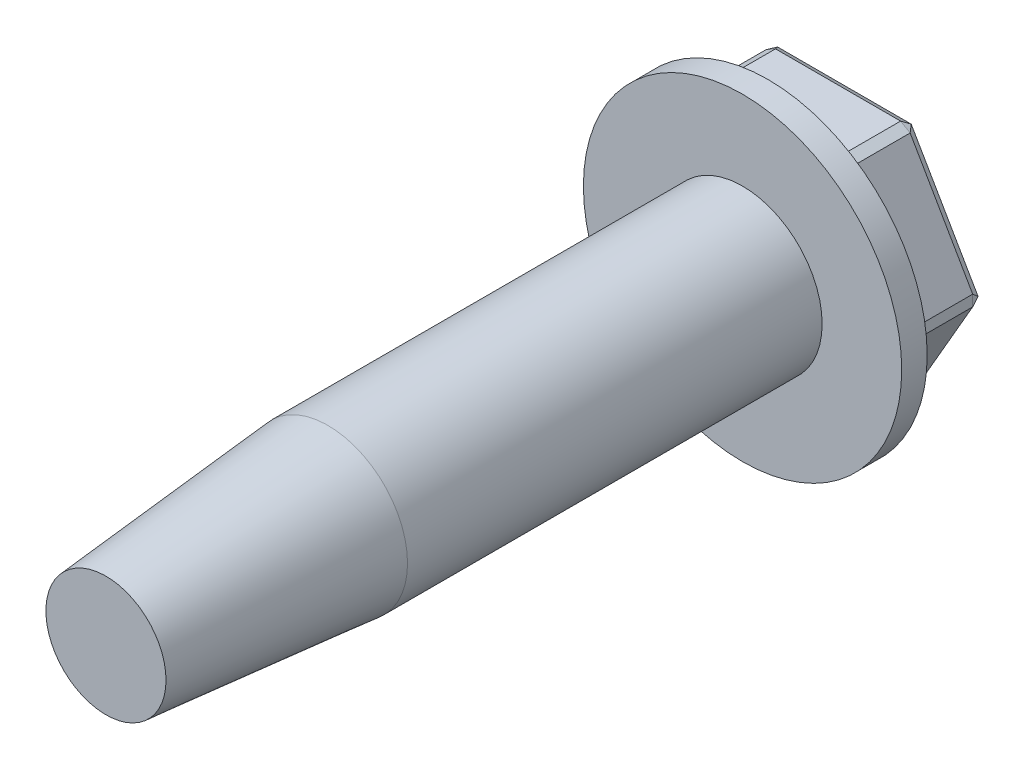
ISO-10303-21;
HEADER;
FILE_DESCRIPTION(('STEP AP214'),'2;1');
FILE_NAME('part.step','',(''),(''),'','','');
FILE_SCHEMA(('AUTOMOTIVE_DESIGN { 1 0 10303 214 1 1 1 1 }'));
ENDSEC;
DATA;
#1=APPLICATION_CONTEXT('core data for automotive mechanical design processes');
#2=APPLICATION_PROTOCOL_DEFINITION('international standard','automotive_design',2000,#1);
#3=PRODUCT_CONTEXT('',#1,'mechanical');
#4=PRODUCT('Part','Part','',(#3));
#5=PRODUCT_RELATED_PRODUCT_CATEGORY('part','',(#4));
#6=PRODUCT_DEFINITION_FORMATION('','',#4);
#7=PRODUCT_DEFINITION_CONTEXT('part definition',#1,'design');
#8=PRODUCT_DEFINITION('design','',#6,#7);
#9=PRODUCT_DEFINITION_SHAPE('','',#8);
#10=(LENGTH_UNIT() NAMED_UNIT(*) SI_UNIT(.MILLI.,.METRE.));
#11=(NAMED_UNIT(*) PLANE_ANGLE_UNIT() SI_UNIT($,.RADIAN.));
#12=(NAMED_UNIT(*) SI_UNIT($,.STERADIAN.) SOLID_ANGLE_UNIT());
#13=UNCERTAINTY_MEASURE_WITH_UNIT(LENGTH_MEASURE(1.E-05),#10,'distance_accuracy_value','');
#14=(GEOMETRIC_REPRESENTATION_CONTEXT(3) GLOBAL_UNCERTAINTY_ASSIGNED_CONTEXT((#13)) GLOBAL_UNIT_ASSIGNED_CONTEXT((#10,
#11,#12)) REPRESENTATION_CONTEXT('',''));
#15=CARTESIAN_POINT('',(0.,0.,0.));
#16=DIRECTION('',(0.,0.,1.));
#17=DIRECTION('',(1.,0.,0.));
#18=AXIS2_PLACEMENT_3D('',#15,#16,#17);
#19=CARTESIAN_POINT('',(6.35,0.,4.064));
#20=DIRECTION('',(0.,0.,1.));
#21=DIRECTION('',(1.,0.,0.));
#22=AXIS2_PLACEMENT_3D('',#19,#20,#21);
#23=PLANE('',#22);
#24=CARTESIAN_POINT('',(0.,0.,4.06399999999999));
#25=DIRECTION('',(0.,0.,-1.));
#26=DIRECTION('',(-1.,0.,0.));
#27=AXIS2_PLACEMENT_3D('',#24,#25,#26);
#28=CIRCLE('',#27,6.35);
#29=CARTESIAN_POINT('',(-6.35,0.,4.06399999999999));
#30=VERTEX_POINT('',#29);
#31=EDGE_CURVE('E188',#30,#30,#28,.T.);
#32=ORIENTED_EDGE('',*,*,#31,.F.);
#33=EDGE_LOOP('',(#32));
#34=FACE_BOUND('',#33,.T.);
#35=CARTESIAN_POINT('',(0.,0.,4.064));
#36=DIRECTION('',(0.,0.,1.));
#37=DIRECTION('',(1.,0.,0.));
#38=AXIS2_PLACEMENT_3D('',#35,#36,#37);
#39=CIRCLE('',#38,3.175);
#40=CARTESIAN_POINT('',(3.175,0.,4.064));
#41=VERTEX_POINT('',#40);
#42=EDGE_CURVE('E291',#41,#41,#39,.T.);
#43=ORIENTED_EDGE('',*,*,#42,.F.);
#44=EDGE_LOOP('',(#43));
#45=FACE_BOUND('',#44,.T.);
#46=ADVANCED_FACE('F34',(#34,#45),#23,.T.);
#47=CARTESIAN_POINT('',(0.,0.,3.048));
#48=DIRECTION('',(0.,0.,-1.));
#49=DIRECTION('',(-1.,0.,0.));
#50=AXIS2_PLACEMENT_3D('',#47,#48,#49);
#51=PLANE('',#50);
#52=CARTESIAN_POINT('',(0.,0.,3.048));
#53=DIRECTION('',(0.,0.,-1.));
#54=DIRECTION('',(-1.,0.,0.));
#55=AXIS2_PLACEMENT_3D('',#52,#53,#54);
#56=CIRCLE('',#55,6.35);
#57=CARTESIAN_POINT('',(-6.35,0.,3.048));
#58=VERTEX_POINT('',#57);
#59=EDGE_CURVE('E185',#58,#58,#56,.T.);
#60=ORIENTED_EDGE('',*,*,#59,.T.);
#61=EDGE_LOOP('',(#60));
#62=FACE_BOUND('',#61,.T.);
#63=DIRECTION('',(-0.5,0.866025403784439,0.));
#64=VECTOR('',#63,1.);
#65=CARTESIAN_POINT('',(-5.49926131403118,0.,3.048));
#66=LINE('',#65,#64);
#67=CARTESIAN_POINT('',(-2.87663065701559,-4.54252954743875,3.048));
#68=VERTEX_POINT('',#67);
#69=CARTESIAN_POINT('',(-5.37226131403118,-0.219970452561247,3.048));
#70=VERTEX_POINT('',#69);
#71=EDGE_CURVE('E179',#68,#70,#66,.T.);
#72=ORIENTED_EDGE('',*,*,#71,.F.);
#73=DIRECTION('',(-0.866025403784439,0.5,0.));
#74=VECTOR('',#73,1.);
#75=CARTESIAN_POINT('',(-2.87663065701559,-4.54252954743875,3.048));
#76=LINE('',#75,#74);
#77=CARTESIAN_POINT('',(-2.49563065701559,-4.76249999999999,3.048));
#78=VERTEX_POINT('',#77);
#79=EDGE_CURVE('E233',#68,#78,#76,.F.);
#80=ORIENTED_EDGE('',*,*,#79,.T.);
#81=DIRECTION('',(-1.,0.,0.));
#82=VECTOR('',#81,1.);
#83=CARTESIAN_POINT('',(-2.74963065701559,-4.76249999999999,3.048));
#84=LINE('',#83,#82);
#85=CARTESIAN_POINT('',(2.49563065701559,-4.7625,3.048));
#86=VERTEX_POINT('',#85);
#87=EDGE_CURVE('E300',#86,#78,#84,.T.);
#88=ORIENTED_EDGE('',*,*,#87,.F.);
#89=DIRECTION('',(-0.866025403784436,-0.500000000000005,0.));
#90=VECTOR('',#89,1.);
#91=CARTESIAN_POINT('',(2.49563065701559,-4.7625,3.048));
#92=LINE('',#91,#90);
#93=CARTESIAN_POINT('',(2.8766306570156,-4.54252954743875,3.048));
#94=VERTEX_POINT('',#93);
#95=EDGE_CURVE('E11',#86,#94,#92,.F.);
#96=ORIENTED_EDGE('',*,*,#95,.T.);
#97=DIRECTION('',(-0.5,-0.866025403784439,0.));
#98=VECTOR('',#97,1.);
#99=CARTESIAN_POINT('',(2.74963065701559,-4.7625,3.048));
#100=LINE('',#99,#98);
#101=CARTESIAN_POINT('',(5.37226131403119,-0.21997045256125,3.048));
#102=VERTEX_POINT('',#101);
#103=EDGE_CURVE('E177',#102,#94,#100,.T.);
#104=ORIENTED_EDGE('',*,*,#103,.F.);
#105=DIRECTION('',(0.,-1.,0.));
#106=VECTOR('',#105,1.);
#107=CARTESIAN_POINT('',(5.37226131403118,-0.21997045256125,3.048));
#108=LINE('',#107,#106);
#109=CARTESIAN_POINT('',(5.37226131403118,0.219970452561261,3.048));
#110=VERTEX_POINT('',#109);
#111=EDGE_CURVE('E43',#102,#110,#108,.F.);
#112=ORIENTED_EDGE('',*,*,#111,.T.);
#113=DIRECTION('',(0.5,-0.866025403784439,0.));
#114=VECTOR('',#113,1.);
#115=CARTESIAN_POINT('',(5.49926131403119,0.,3.048));
#116=LINE('',#115,#114);
#117=CARTESIAN_POINT('',(2.8766306570156,4.54252954743876,3.048));
#118=VERTEX_POINT('',#117);
#119=EDGE_CURVE('E173',#118,#110,#116,.T.);
#120=ORIENTED_EDGE('',*,*,#119,.F.);
#121=DIRECTION('',(0.866025403784438,-0.500000000000001,0.));
#122=VECTOR('',#121,1.);
#123=CARTESIAN_POINT('',(2.8766306570156,4.54252954743876,3.048));
#124=LINE('',#123,#122);
#125=CARTESIAN_POINT('',(2.4956306570156,4.7625,3.048));
#126=VERTEX_POINT('',#125);
#127=EDGE_CURVE('E172',#118,#126,#124,.F.);
#128=ORIENTED_EDGE('',*,*,#127,.T.);
#129=DIRECTION('',(1.,0.,0.));
#130=VECTOR('',#129,1.);
#131=CARTESIAN_POINT('',(2.7496306570156,4.7625,3.048));
#132=LINE('',#131,#130);
#133=CARTESIAN_POINT('',(-2.49563065701558,4.76250000000001,3.048));
#134=VERTEX_POINT('',#133);
#135=EDGE_CURVE('E161',#134,#126,#132,.T.);
#136=ORIENTED_EDGE('',*,*,#135,.F.);
#137=DIRECTION('',(0.866025403784437,0.500000000000002,0.));
#138=VECTOR('',#137,1.);
#139=CARTESIAN_POINT('',(-2.49563065701558,4.76250000000001,3.048));
#140=LINE('',#139,#138);
#141=CARTESIAN_POINT('',(-2.87663065701559,4.54252954743875,3.048));
#142=VERTEX_POINT('',#141);
#143=EDGE_CURVE('E145',#134,#142,#140,.F.);
#144=ORIENTED_EDGE('',*,*,#143,.T.);
#145=DIRECTION('',(0.5,0.866025403784439,0.));
#146=VECTOR('',#145,1.);
#147=CARTESIAN_POINT('',(-2.74963065701559,4.76250000000001,3.048));
#148=LINE('',#147,#146);
#149=CARTESIAN_POINT('',(-5.37226131403118,0.219970452561256,3.048));
#150=VERTEX_POINT('',#149);
#151=EDGE_CURVE('E174',#150,#142,#148,.T.);
#152=ORIENTED_EDGE('',*,*,#151,.F.);
#153=DIRECTION('',(0.,1.,0.));
#154=VECTOR('',#153,1.);
#155=CARTESIAN_POINT('',(-5.37226131403118,0.219970452561257,3.048));
#156=LINE('',#155,#154);
#157=EDGE_CURVE('E155',#150,#70,#156,.F.);
#158=ORIENTED_EDGE('',*,*,#157,.T.);
#159=EDGE_LOOP('',(#72,#80,#88,#96,#104,#112,#120,#128,#136,#144,#152,#158));
#160=FACE_BOUND('',#159,.T.);
#161=ADVANCED_FACE('F169',(#62,#160),#51,.T.);
#162=CARTESIAN_POINT('',(0.,0.,4.064));
#163=DIRECTION('',(0.,0.,-1.));
#164=DIRECTION('',(-1.,0.,0.));
#165=AXIS2_PLACEMENT_3D('',#162,#163,#164);
#166=CYLINDRICAL_SURFACE('',#165,6.35);
#167=ORIENTED_EDGE('',*,*,#31,.T.);
#168=EDGE_LOOP('',(#167));
#169=FACE_BOUND('',#168,.T.);
#170=ORIENTED_EDGE('',*,*,#59,.F.);
#171=EDGE_LOOP('',(#170));
#172=FACE_BOUND('',#171,.T.);
#173=ADVANCED_FACE('F391',(#169,#172),#166,.T.);
#174=CARTESIAN_POINT('',(-2.74963065701559,-4.76249999999999,0.));
#175=DIRECTION('',(0.,1.,0.));
#176=DIRECTION('',(-1.,0.,0.));
#177=AXIS2_PLACEMENT_3D('',#174,#175,#176);
#178=PLANE('',#177);
#179=ORIENTED_EDGE('',*,*,#87,.T.);
#180=DIRECTION('',(0.,0.,-1.));
#181=VECTOR('',#180,1.);
#182=CARTESIAN_POINT('',(-2.49563065701559,-4.76249999999999,0.));
#183=LINE('',#182,#181);
#184=CARTESIAN_POINT('',(-2.49563065701559,-4.76249999999999,0.254000000000007));
#185=VERTEX_POINT('',#184);
#186=EDGE_CURVE('E213',#78,#185,#183,.T.);
#187=ORIENTED_EDGE('',*,*,#186,.T.);
#188=DIRECTION('',(1.,0.,0.));
#189=VECTOR('',#188,1.);
#190=CARTESIAN_POINT('',(-2.74963065701559,-4.76249999999999,0.254000000000007));
#191=LINE('',#190,#189);
#192=CARTESIAN_POINT('',(2.49563065701559,-4.7625,0.254000000000007));
#193=VERTEX_POINT('',#192);
#194=EDGE_CURVE('E211',#185,#193,#191,.T.);
#195=ORIENTED_EDGE('',*,*,#194,.T.);
#196=DIRECTION('',(0.,0.,1.));
#197=VECTOR('',#196,1.);
#198=CARTESIAN_POINT('',(2.49563065701559,-4.7625,0.));
#199=LINE('',#198,#197);
#200=EDGE_CURVE('E209',#193,#86,#199,.T.);
#201=ORIENTED_EDGE('',*,*,#200,.T.);
#202=EDGE_LOOP('',(#179,#187,#195,#201));
#203=FACE_BOUND('',#202,.T.);
#204=ADVANCED_FACE('F332',(#203),#178,.F.);
#205=CARTESIAN_POINT('',(-5.49926131403118,0.,0.));
#206=DIRECTION('',(0.866025403784439,0.5,0.));
#207=DIRECTION('',(-0.5,0.866025403784439,0.));
#208=AXIS2_PLACEMENT_3D('',#205,#206,#207);
#209=PLANE('',#208);
#210=ORIENTED_EDGE('',*,*,#71,.T.);
#211=DIRECTION('',(0.,0.,-1.));
#212=VECTOR('',#211,1.);
#213=CARTESIAN_POINT('',(-5.37226131403118,-0.219970452561246,0.));
#214=LINE('',#213,#212);
#215=CARTESIAN_POINT('',(-5.37226131403118,-0.219970452561247,0.254000000000007));
#216=VERTEX_POINT('',#215);
#217=EDGE_CURVE('E201',#70,#216,#214,.T.);
#218=ORIENTED_EDGE('',*,*,#217,.T.);
#219=DIRECTION('',(0.5,-0.866025403784439,0.));
#220=VECTOR('',#219,1.);
#221=CARTESIAN_POINT('',(-5.49926131403118,0.,0.254000000000007));
#222=LINE('',#221,#220);
#223=CARTESIAN_POINT('',(-2.87663065701559,-4.54252954743875,0.254000000000007));
#224=VERTEX_POINT('',#223);
#225=EDGE_CURVE('E197',#216,#224,#222,.T.);
#226=ORIENTED_EDGE('',*,*,#225,.T.);
#227=DIRECTION('',(0.,0.,1.));
#228=VECTOR('',#227,1.);
#229=CARTESIAN_POINT('',(-2.87663065701559,-4.54252954743875,0.));
#230=LINE('',#229,#228);
#231=EDGE_CURVE('E199',#224,#68,#230,.T.);
#232=ORIENTED_EDGE('',*,*,#231,.T.);
#233=EDGE_LOOP('',(#210,#218,#226,#232));
#234=FACE_BOUND('',#233,.T.);
#235=ADVANCED_FACE('F306',(#234),#209,.F.);
#236=CARTESIAN_POINT('',(-2.74963065701559,4.76250000000001,0.));
#237=DIRECTION('',(0.866025403784439,-0.5,0.));
#238=DIRECTION('',(0.5,0.866025403784439,0.));
#239=AXIS2_PLACEMENT_3D('',#236,#237,#238);
#240=PLANE('',#239);
#241=ORIENTED_EDGE('',*,*,#151,.T.);
#242=DIRECTION('',(0.,0.,-1.));
#243=VECTOR('',#242,1.);
#244=CARTESIAN_POINT('',(-2.87663065701559,4.54252954743875,0.));
#245=LINE('',#244,#243);
#246=CARTESIAN_POINT('',(-2.87663065701559,4.54252954743875,0.254000000000007));
#247=VERTEX_POINT('',#246);
#248=EDGE_CURVE('E150',#142,#247,#245,.T.);
#249=ORIENTED_EDGE('',*,*,#248,.T.);
#250=DIRECTION('',(-0.5,-0.866025403784439,0.));
#251=VECTOR('',#250,1.);
#252=CARTESIAN_POINT('',(-2.74963065701559,4.76250000000001,0.254000000000007));
#253=LINE('',#252,#251);
#254=CARTESIAN_POINT('',(-5.37226131403118,0.219970452561257,0.254000000000007));
#255=VERTEX_POINT('',#254);
#256=EDGE_CURVE('E165',#247,#255,#253,.T.);
#257=ORIENTED_EDGE('',*,*,#256,.T.);
#258=DIRECTION('',(0.,0.,1.));
#259=VECTOR('',#258,1.);
#260=CARTESIAN_POINT('',(-5.37226131403118,0.219970452561258,0.));
#261=LINE('',#260,#259);
#262=EDGE_CURVE('E194',#255,#150,#261,.T.);
#263=ORIENTED_EDGE('',*,*,#262,.T.);
#264=EDGE_LOOP('',(#241,#249,#257,#263));
#265=FACE_BOUND('',#264,.T.);
#266=ADVANCED_FACE('F376',(#265),#240,.F.);
#267=CARTESIAN_POINT('',(2.7496306570156,4.7625,0.));
#268=DIRECTION('',(0.,-1.,0.));
#269=DIRECTION('',(1.,0.,0.));
#270=AXIS2_PLACEMENT_3D('',#267,#268,#269);
#271=PLANE('',#270);
#272=DIRECTION('',(-1.,0.,0.));
#273=VECTOR('',#272,1.);
#274=CARTESIAN_POINT('',(2.7496306570156,4.7625,0.254000000000007));
#275=LINE('',#274,#273);
#276=CARTESIAN_POINT('',(2.4956306570156,4.7625,0.254000000000007));
#277=VERTEX_POINT('',#276);
#278=CARTESIAN_POINT('',(-2.49563065701558,4.76250000000001,0.254000000000007));
#279=VERTEX_POINT('',#278);
#280=EDGE_CURVE('E164',#277,#279,#275,.T.);
#281=ORIENTED_EDGE('',*,*,#280,.T.);
#282=DIRECTION('',(0.,0.,1.));
#283=VECTOR('',#282,1.);
#284=CARTESIAN_POINT('',(-2.49563065701558,4.76250000000001,0.));
#285=LINE('',#284,#283);
#286=EDGE_CURVE('E149',#279,#134,#285,.T.);
#287=ORIENTED_EDGE('',*,*,#286,.T.);
#288=ORIENTED_EDGE('',*,*,#135,.T.);
#289=DIRECTION('',(0.,0.,-1.));
#290=VECTOR('',#289,1.);
#291=CARTESIAN_POINT('',(2.4956306570156,4.7625,0.));
#292=LINE('',#291,#290);
#293=EDGE_CURVE('E166',#126,#277,#292,.T.);
#294=ORIENTED_EDGE('',*,*,#293,.T.);
#295=EDGE_LOOP('',(#281,#287,#288,#294));
#296=FACE_BOUND('',#295,.T.);
#297=ADVANCED_FACE('F160',(#296),#271,.F.);
#298=CARTESIAN_POINT('',(5.49926131403119,0.,0.));
#299=DIRECTION('',(-0.866025403784439,-0.5,0.));
#300=DIRECTION('',(0.5,-0.866025403784439,0.));
#301=AXIS2_PLACEMENT_3D('',#298,#299,#300);
#302=PLANE('',#301);
#303=DIRECTION('',(-0.5,0.866025403784439,0.));
#304=VECTOR('',#303,1.);
#305=CARTESIAN_POINT('',(5.49926131403119,0.,0.254000000000008));
#306=LINE('',#305,#304);
#307=CARTESIAN_POINT('',(5.37226131403118,0.219970452561261,0.254000000000008));
#308=VERTEX_POINT('',#307);
#309=CARTESIAN_POINT('',(2.8766306570156,4.54252954743875,0.254000000000008));
#310=VERTEX_POINT('',#309);
#311=EDGE_CURVE('E203',#308,#310,#306,.T.);
#312=ORIENTED_EDGE('',*,*,#311,.T.);
#313=DIRECTION('',(0.,0.,1.));
#314=VECTOR('',#313,1.);
#315=CARTESIAN_POINT('',(2.8766306570156,4.54252954743876,0.));
#316=LINE('',#315,#314);
#317=EDGE_CURVE('E207',#310,#118,#316,.T.);
#318=ORIENTED_EDGE('',*,*,#317,.T.);
#319=ORIENTED_EDGE('',*,*,#119,.T.);
#320=DIRECTION('',(0.,0.,-1.));
#321=VECTOR('',#320,1.);
#322=CARTESIAN_POINT('',(5.37226131403118,0.219970452561261,0.));
#323=LINE('',#322,#321);
#324=EDGE_CURVE('E205',#110,#308,#323,.T.);
#325=ORIENTED_EDGE('',*,*,#324,.T.);
#326=EDGE_LOOP('',(#312,#318,#319,#325));
#327=FACE_BOUND('',#326,.T.);
#328=ADVANCED_FACE('F361',(#327),#302,.F.);
#329=CARTESIAN_POINT('',(2.74963065701559,-4.7625,0.));
#330=DIRECTION('',(-0.866025403784439,0.5,0.));
#331=DIRECTION('',(-0.5,-0.866025403784439,0.));
#332=AXIS2_PLACEMENT_3D('',#329,#330,#331);
#333=PLANE('',#332);
#334=DIRECTION('',(0.5,0.866025403784439,0.));
#335=VECTOR('',#334,1.);
#336=CARTESIAN_POINT('',(2.74963065701559,-4.7625,0.254000000000007));
#337=LINE('',#336,#335);
#338=CARTESIAN_POINT('',(2.8766306570156,-4.54252954743875,0.254000000000007));
#339=VERTEX_POINT('',#338);
#340=CARTESIAN_POINT('',(5.37226131403118,-0.219970452561251,0.254000000000007));
#341=VERTEX_POINT('',#340);
#342=EDGE_CURVE('E217',#339,#341,#337,.T.);
#343=ORIENTED_EDGE('',*,*,#342,.T.);
#344=DIRECTION('',(0.,0.,1.));
#345=VECTOR('',#344,1.);
#346=CARTESIAN_POINT('',(5.37226131403118,-0.219970452561251,0.));
#347=LINE('',#346,#345);
#348=EDGE_CURVE('E219',#341,#102,#347,.T.);
#349=ORIENTED_EDGE('',*,*,#348,.T.);
#350=ORIENTED_EDGE('',*,*,#103,.T.);
#351=DIRECTION('',(0.,0.,-1.));
#352=VECTOR('',#351,1.);
#353=CARTESIAN_POINT('',(2.8766306570156,-4.54252954743875,0.));
#354=LINE('',#353,#352);
#355=EDGE_CURVE('E215',#94,#339,#354,.T.);
#356=ORIENTED_EDGE('',*,*,#355,.T.);
#357=EDGE_LOOP('',(#343,#349,#350,#356));
#358=FACE_BOUND('',#357,.T.);
#359=ADVANCED_FACE('F340',(#358),#333,.F.);
#360=CARTESIAN_POINT('',(2.74963065701559,-4.7625,0.));
#361=DIRECTION('',(0.,0.,1.));
#362=DIRECTION('',(1.,0.,0.));
#363=AXIS2_PLACEMENT_3D('',#360,#361,#362);
#364=PLANE('',#363);
#365=DIRECTION('',(-0.5,0.866025403784439,0.));
#366=VECTOR('',#365,1.);
#367=CARTESIAN_POINT('',(-1.24781532850779,-7.07042651581291,0.));
#368=LINE('',#367,#366);
#369=CARTESIAN_POINT('',(-2.66496399034892,-4.61585303162583,0.));
#370=VERTEX_POINT('',#369);
#371=CARTESIAN_POINT('',(-5.32992798069785,0.,0.));
#372=VERTEX_POINT('',#371);
#373=EDGE_CURVE('E59',#370,#372,#368,.T.);
#374=ORIENTED_EDGE('',*,*,#373,.T.);
#375=DIRECTION('',(0.5,0.866025403784439,0.));
#376=VECTOR('',#375,1.);
#377=CARTESIAN_POINT('',(-5.37226131403118,-0.0733234841870855,0.));
#378=LINE('',#377,#376);
#379=CARTESIAN_POINT('',(-2.66496399034892,4.61585303162584,0.));
#380=VERTEX_POINT('',#379);
#381=EDGE_CURVE('E156',#372,#380,#378,.T.);
#382=ORIENTED_EDGE('',*,*,#381,.T.);
#383=DIRECTION('',(1.,0.,0.));
#384=VECTOR('',#383,1.);
#385=CARTESIAN_POINT('',(2.74963065701561,4.61585303162584,0.));
#386=LINE('',#385,#384);
#387=CARTESIAN_POINT('',(2.66496399034893,4.61585303162584,0.));
#388=VERTEX_POINT('',#387);
#389=EDGE_CURVE('E228',#380,#388,#386,.T.);
#390=ORIENTED_EDGE('',*,*,#389,.T.);
#391=DIRECTION('',(0.5,-0.866025403784439,0.));
#392=VECTOR('',#391,1.);
#393=CARTESIAN_POINT('',(6.74707664253899,-2.45457348418708,0.));
#394=LINE('',#393,#392);
#395=CARTESIAN_POINT('',(5.32992798069786,0.,0.));
#396=VERTEX_POINT('',#395);
#397=EDGE_CURVE('E225',#388,#396,#394,.T.);
#398=ORIENTED_EDGE('',*,*,#397,.T.);
#399=DIRECTION('',(-0.5,-0.866025403784439,0.));
#400=VECTOR('',#399,1.);
#401=CARTESIAN_POINT('',(2.62263065701559,-4.68917651581292,0.));
#402=LINE('',#401,#400);
#403=CARTESIAN_POINT('',(2.66496399034893,-4.61585303162583,0.));
#404=VERTEX_POINT('',#403);
#405=EDGE_CURVE('E221',#396,#404,#402,.T.);
#406=ORIENTED_EDGE('',*,*,#405,.T.);
#407=DIRECTION('',(-1.,0.,0.));
#408=VECTOR('',#407,1.);
#409=CARTESIAN_POINT('',(2.74963065701559,-4.61585303162583,0.));
#410=LINE('',#409,#408);
#411=EDGE_CURVE('E223',#404,#370,#410,.T.);
#412=ORIENTED_EDGE('',*,*,#411,.T.);
#413=EDGE_LOOP('',(#374,#382,#390,#398,#406,#412));
#414=FACE_BOUND('',#413,.T.);
#415=ADVANCED_FACE('F452',(#414),#364,.F.);
#416=CARTESIAN_POINT('',(0.,0.,20.6062086712946));
#417=DIRECTION('',(0.,0.,-1.));
#418=DIRECTION('',(-1.,0.,0.));
#419=AXIS2_PLACEMENT_3D('',#416,#417,#418);
#420=CYLINDRICAL_SURFACE('',#419,3.175);
#421=CARTESIAN_POINT('',(0.,0.,20.6062086712946));
#422=DIRECTION('',(0.,0.,1.));
#423=DIRECTION('',(1.,0.,0.));
#424=AXIS2_PLACEMENT_3D('',#421,#422,#423);
#425=CIRCLE('',#424,3.175);
#426=CARTESIAN_POINT('',(3.175,0.,20.6062086712946));
#427=VERTEX_POINT('',#426);
#428=EDGE_CURVE('E296',#427,#427,#425,.T.);
#429=ORIENTED_EDGE('',*,*,#428,.F.);
#430=EDGE_LOOP('',(#429));
#431=FACE_BOUND('',#430,.T.);
#432=ORIENTED_EDGE('',*,*,#42,.T.);
#433=EDGE_LOOP('',(#432));
#434=FACE_BOUND('',#433,.T.);
#435=ADVANCED_FACE('F446',(#431,#434),#420,.T.);
#436=CARTESIAN_POINT('',(0.,0.,20.6062086712946));
#437=DIRECTION('',(0.,0.,-1.));
#438=DIRECTION('',(1.,0.,0.));
#439=AXIS2_PLACEMENT_3D('',#436,#437,#438);
#440=CONICAL_SURFACE('',#439,3.17500000000145,0.0876862462690813);
#441=CARTESIAN_POINT('',(0.,0.,29.464));
#442=DIRECTION('',(0.,0.,1.));
#443=DIRECTION('',(1.,0.,0.));
#444=AXIS2_PLACEMENT_3D('',#441,#442,#443);
#445=CIRCLE('',#444,2.39629671959518);
#446=CARTESIAN_POINT('',(2.39629671959518,0.,29.464));
#447=VERTEX_POINT('',#446);
#448=EDGE_CURVE('E286',#447,#447,#445,.T.);
#449=ORIENTED_EDGE('',*,*,#448,.F.);
#450=EDGE_LOOP('',(#449));
#451=FACE_BOUND('',#450,.T.);
#452=ORIENTED_EDGE('',*,*,#428,.T.);
#453=EDGE_LOOP('',(#452));
#454=FACE_BOUND('',#453,.T.);
#455=ADVANCED_FACE('F441',(#451,#454),#440,.T.);
#456=CARTESIAN_POINT('',(0.,0.,29.464));
#457=DIRECTION('',(0.,0.,1.));
#458=DIRECTION('',(1.,0.,0.));
#459=AXIS2_PLACEMENT_3D('',#456,#457,#458);
#460=PLANE('',#459);
#461=ORIENTED_EDGE('',*,*,#448,.T.);
#462=EDGE_LOOP('',(#461));
#463=FACE_BOUND('',#462,.T.);
#464=ADVANCED_FACE('F437',(#463),#460,.T.);
#465=CARTESIAN_POINT('',(2.49563065701559,-4.7625,0.));
#466=DIRECTION('',(-0.500000000000005,0.866025403784436,0.));
#467=DIRECTION('',(-0.866025403784436,-0.500000000000005,0.));
#468=AXIS2_PLACEMENT_3D('',#465,#466,#467);
#469=PLANE('',#468);
#470=DIRECTION('',(0.866025403784436,0.500000000000005,0.));
#471=VECTOR('',#470,1.);
#472=CARTESIAN_POINT('',(2.49563065701559,-4.7625,0.254000000000005));
#473=LINE('',#472,#471);
#474=EDGE_CURVE('E38',#339,#193,#473,.F.);
#475=ORIENTED_EDGE('',*,*,#474,.F.);
#476=ORIENTED_EDGE('',*,*,#355,.F.);
#477=ORIENTED_EDGE('',*,*,#95,.F.);
#478=ORIENTED_EDGE('',*,*,#200,.F.);
#479=EDGE_LOOP('',(#475,#476,#477,#478));
#480=FACE_BOUND('',#479,.T.);
#481=ADVANCED_FACE('F36',(#480),#469,.F.);
#482=CARTESIAN_POINT('',(2.49563065701559,-4.7625,0.254000000000007));
#483=DIRECTION('',(0.493196961916077,-0.854242196177247,-0.164398987305354));
#484=DIRECTION('',(0.866025403784436,0.500000000000005,0.));
#485=AXIS2_PLACEMENT_3D('',#482,#483,#484);
#486=PLANE('',#485);
#487=DIRECTION('',(-0.625000000000004,-0.216506350946121,-0.749999999999994));
#488=VECTOR('',#487,1.);
#489=CARTESIAN_POINT('',(2.69803690701559,-4.6043962372216,0.0396875000000036));
#490=LINE('',#489,#488);
#491=EDGE_CURVE('E277',#339,#404,#490,.T.);
#492=ORIENTED_EDGE('',*,*,#491,.F.);
#493=ORIENTED_EDGE('',*,*,#474,.T.);
#494=DIRECTION('',(-0.499999999999997,-0.433012701892219,0.750000000000003));
#495=VECTOR('',#494,1.);
#496=CARTESIAN_POINT('',(2.49563065701559,-4.7625,0.254000000000007));
#497=LINE('',#496,#495);
#498=EDGE_CURVE('E279',#404,#193,#497,.T.);
#499=ORIENTED_EDGE('',*,*,#498,.F.);
#500=EDGE_LOOP('',(#492,#493,#499));
#501=FACE_BOUND('',#500,.T.);
#502=ADVANCED_FACE('F432',(#501),#486,.T.);
#503=CARTESIAN_POINT('',(-2.87663065701559,-4.54252954743875,0.));
#504=DIRECTION('',(0.5,0.866025403784439,0.));
#505=DIRECTION('',(-0.866025403784439,0.5,0.));
#506=AXIS2_PLACEMENT_3D('',#503,#504,#505);
#507=PLANE('',#506);
#508=ORIENTED_EDGE('',*,*,#79,.F.);
#509=ORIENTED_EDGE('',*,*,#231,.F.);
#510=DIRECTION('',(0.866025403784438,-0.5,0.));
#511=VECTOR('',#510,1.);
#512=CARTESIAN_POINT('',(-2.49563065701559,-4.76249999999999,0.254000000000008));
#513=LINE('',#512,#511);
#514=EDGE_CURVE('E274',#185,#224,#513,.F.);
#515=ORIENTED_EDGE('',*,*,#514,.F.);
#516=ORIENTED_EDGE('',*,*,#186,.F.);
#517=EDGE_LOOP('',(#508,#509,#515,#516));
#518=FACE_BOUND('',#517,.T.);
#519=ADVANCED_FACE('F324',(#518),#507,.F.);
#520=CARTESIAN_POINT('',(2.74963065701559,-4.61585303162583,0.));
#521=DIRECTION('',(0.,0.866025403784439,0.499999999999999));
#522=DIRECTION('',(0.,-0.499999999999999,0.866025403784439));
#523=AXIS2_PLACEMENT_3D('',#520,#521,#522);
#524=PLANE('',#523);
#525=ORIENTED_EDGE('',*,*,#498,.T.);
#526=ORIENTED_EDGE('',*,*,#194,.F.);
#527=DIRECTION('',(-0.499999999999994,0.433012701892221,-0.750000000000003));
#528=VECTOR('',#527,1.);
#529=CARTESIAN_POINT('',(-2.49563065701559,-4.76249999999999,0.254000000000006));
#530=LINE('',#529,#528);
#531=EDGE_CURVE('E271',#370,#185,#530,.F.);
#532=ORIENTED_EDGE('',*,*,#531,.F.);
#533=ORIENTED_EDGE('',*,*,#411,.F.);
#534=EDGE_LOOP('',(#525,#526,#532,#533));
#535=FACE_BOUND('',#534,.T.);
#536=ADVANCED_FACE('F329',(#535),#524,.F.);
#537=CARTESIAN_POINT('',(2.62263065701559,-4.68917651581292,0.));
#538=DIRECTION('',(-0.749999999999999,0.433012701892219,0.500000000000001));
#539=DIRECTION('',(0.55470019622523,0.,0.832050294337843));
#540=AXIS2_PLACEMENT_3D('',#537,#538,#539);
#541=PLANE('',#540);
#542=ORIENTED_EDGE('',*,*,#491,.T.);
#543=ORIENTED_EDGE('',*,*,#405,.F.);
#544=DIRECTION('',(0.124999999999985,-0.649519052838345,0.749999999999989));
#545=VECTOR('',#544,1.);
#546=CARTESIAN_POINT('',(5.33654256403119,-0.0343703832126826,0.0396874999999972));
#547=LINE('',#546,#545);
#548=EDGE_CURVE('E268',#341,#396,#547,.F.);
#549=ORIENTED_EDGE('',*,*,#548,.F.);
#550=ORIENTED_EDGE('',*,*,#342,.F.);
#551=EDGE_LOOP('',(#542,#543,#549,#550));
#552=FACE_BOUND('',#551,.T.);
#553=ADVANCED_FACE('F351',(#552),#541,.F.);
#554=CARTESIAN_POINT('',(5.37226131403118,-0.21997045256125,0.));
#555=DIRECTION('',(-1.,0.,0.));
#556=DIRECTION('',(0.,0.,1.));
#557=AXIS2_PLACEMENT_3D('',#554,#555,#556);
#558=PLANE('',#557);
#559=ORIENTED_EDGE('',*,*,#111,.F.);
#560=ORIENTED_EDGE('',*,*,#348,.F.);
#561=DIRECTION('',(0.,1.,0.));
#562=VECTOR('',#561,1.);
#563=CARTESIAN_POINT('',(5.37226131403118,0.219970452561261,0.254000000000008));
#564=LINE('',#563,#562);
#565=EDGE_CURVE('E265',#308,#341,#564,.F.);
#566=ORIENTED_EDGE('',*,*,#565,.F.);
#567=ORIENTED_EDGE('',*,*,#324,.F.);
#568=EDGE_LOOP('',(#559,#560,#566,#567));
#569=FACE_BOUND('',#568,.T.);
#570=ADVANCED_FACE('F346',(#569),#558,.F.);
#571=CARTESIAN_POINT('',(-2.49563065701559,-4.76249999999999,0.254000000000007));
#572=DIRECTION('',(-0.493196961916071,-0.854242196177249,-0.164398987305362));
#573=DIRECTION('',(0.866025403784439,-0.5,0.));
#574=AXIS2_PLACEMENT_3D('',#571,#572,#573);
#575=PLANE('',#574);
#576=ORIENTED_EDGE('',*,*,#531,.T.);
#577=ORIENTED_EDGE('',*,*,#514,.T.);
#578=DIRECTION('',(-0.624999999999999,0.216506350946104,0.750000000000003));
#579=VECTOR('',#578,1.);
#580=CARTESIAN_POINT('',(-2.69803690701559,-4.60439623722159,0.0396875000000092));
#581=LINE('',#580,#579);
#582=EDGE_CURVE('E262',#370,#224,#581,.T.);
#583=ORIENTED_EDGE('',*,*,#582,.F.);
#584=EDGE_LOOP('',(#576,#577,#583));
#585=FACE_BOUND('',#584,.T.);
#586=ADVANCED_FACE('F327',(#585),#575,.T.);
#587=CARTESIAN_POINT('',(5.37226131403118,0.219970452561261,0.254000000000008));
#588=DIRECTION('',(0.986393923832147,0.,-0.164398987305341));
#589=DIRECTION('',(-0.164398987305341,0.,-0.986393923832147));
#590=AXIS2_PLACEMENT_3D('',#587,#588,#589);
#591=PLANE('',#590);
#592=ORIENTED_EDGE('',*,*,#565,.T.);
#593=ORIENTED_EDGE('',*,*,#548,.T.);
#594=DIRECTION('',(-0.124999999999985,-0.649519052838344,-0.749999999999989));
#595=VECTOR('',#594,1.);
#596=CARTESIAN_POINT('',(5.37226131403118,0.219970452561261,0.254000000000007));
#597=LINE('',#596,#595);
#598=EDGE_CURVE('E259',#308,#396,#597,.T.);
#599=ORIENTED_EDGE('',*,*,#598,.F.);
#600=EDGE_LOOP('',(#592,#593,#599));
#601=FACE_BOUND('',#600,.T.);
#602=ADVANCED_FACE('F353',(#601),#591,.T.);
#603=CARTESIAN_POINT('',(-5.37226131403118,0.219970452561257,0.));
#604=DIRECTION('',(1.,0.,0.));
#605=DIRECTION('',(0.,1.,0.));
#606=AXIS2_PLACEMENT_3D('',#603,#604,#605);
#607=PLANE('',#606);
#608=ORIENTED_EDGE('',*,*,#157,.F.);
#609=ORIENTED_EDGE('',*,*,#262,.F.);
#610=DIRECTION('',(0.,-1.,0.));
#611=VECTOR('',#610,1.);
#612=CARTESIAN_POINT('',(-5.37226131403118,-0.219970452561247,0.254000000000007));
#613=LINE('',#612,#611);
#614=EDGE_CURVE('E256',#216,#255,#613,.F.);
#615=ORIENTED_EDGE('',*,*,#614,.F.);
#616=ORIENTED_EDGE('',*,*,#217,.F.);
#617=EDGE_LOOP('',(#608,#609,#615,#616));
#618=FACE_BOUND('',#617,.T.);
#619=ADVANCED_FACE('F313',(#618),#607,.F.);
#620=CARTESIAN_POINT('',(-1.24781532850779,-7.07042651581291,0.));
#621=DIRECTION('',(0.75,0.433012701892219,0.5));
#622=DIRECTION('',(0.554700196225229,0.,-0.832050294337844));
#623=AXIS2_PLACEMENT_3D('',#620,#621,#622);
#624=PLANE('',#623);
#625=ORIENTED_EDGE('',*,*,#582,.T.);
#626=ORIENTED_EDGE('',*,*,#225,.F.);
#627=DIRECTION('',(0.124999999999994,0.649519052838335,-0.749999999999996));
#628=VECTOR('',#627,1.);
#629=CARTESIAN_POINT('',(-5.37226131403118,-0.219970452561246,0.254000000000007));
#630=LINE('',#629,#628);
#631=EDGE_CURVE('E253',#372,#216,#630,.F.);
#632=ORIENTED_EDGE('',*,*,#631,.F.);
#633=ORIENTED_EDGE('',*,*,#373,.F.);
#634=EDGE_LOOP('',(#625,#626,#632,#633));
#635=FACE_BOUND('',#634,.T.);
#636=ADVANCED_FACE('F320',(#635),#624,.F.);
#637=CARTESIAN_POINT('',(6.74707664253899,-2.45457348418708,0.));
#638=DIRECTION('',(-0.75,-0.433012701892219,0.500000000000001));
#639=DIRECTION('',(0.55470019622523,0.,0.832050294337843));
#640=AXIS2_PLACEMENT_3D('',#637,#638,#639);
#641=PLANE('',#640);
#642=ORIENTED_EDGE('',*,*,#598,.T.);
#643=ORIENTED_EDGE('',*,*,#397,.F.);
#644=DIRECTION('',(0.625,-0.216506350946107,0.750000000000001));
#645=VECTOR('',#644,1.);
#646=CARTESIAN_POINT('',(2.6980369070156,4.6043962372216,0.0396875000000077));
#647=LINE('',#646,#645);
#648=EDGE_CURVE('E250',#310,#388,#647,.F.);
#649=ORIENTED_EDGE('',*,*,#648,.F.);
#650=ORIENTED_EDGE('',*,*,#311,.F.);
#651=EDGE_LOOP('',(#642,#643,#649,#650));
#652=FACE_BOUND('',#651,.T.);
#653=ADVANCED_FACE('F358',(#652),#641,.F.);
#654=CARTESIAN_POINT('',(2.8766306570156,4.54252954743876,0.));
#655=DIRECTION('',(-0.500000000000001,-0.866025403784438,0.));
#656=DIRECTION('',(0.866025403784438,-0.500000000000001,0.));
#657=AXIS2_PLACEMENT_3D('',#654,#655,#656);
#658=PLANE('',#657);
#659=ORIENTED_EDGE('',*,*,#127,.F.);
#660=ORIENTED_EDGE('',*,*,#317,.F.);
#661=DIRECTION('',(-0.866025403784438,0.500000000000001,0.));
#662=VECTOR('',#661,1.);
#663=CARTESIAN_POINT('',(2.4956306570156,4.7625,0.254000000000008));
#664=LINE('',#663,#662);
#665=EDGE_CURVE('E247',#277,#310,#664,.F.);
#666=ORIENTED_EDGE('',*,*,#665,.F.);
#667=ORIENTED_EDGE('',*,*,#293,.F.);
#668=EDGE_LOOP('',(#659,#660,#666,#667));
#669=FACE_BOUND('',#668,.T.);
#670=ADVANCED_FACE('F364',(#669),#658,.F.);
#671=CARTESIAN_POINT('',(-5.37226131403118,-0.219970452561247,0.254000000000007));
#672=DIRECTION('',(-0.986393923832144,0.,-0.164398987305352));
#673=DIRECTION('',(-0.164398987305352,0.,0.986393923832145));
#674=AXIS2_PLACEMENT_3D('',#671,#672,#673);
#675=PLANE('',#674);
#676=ORIENTED_EDGE('',*,*,#631,.T.);
#677=ORIENTED_EDGE('',*,*,#614,.T.);
#678=DIRECTION('',(-0.124999999999996,0.649519052838339,0.749999999999991));
#679=VECTOR('',#678,1.);
#680=CARTESIAN_POINT('',(-5.33654256403118,0.0343703832126952,0.0396875000000016));
#681=LINE('',#680,#679);
#682=EDGE_CURVE('E244',#372,#255,#681,.T.);
#683=ORIENTED_EDGE('',*,*,#682,.F.);
#684=EDGE_LOOP('',(#676,#677,#683));
#685=FACE_BOUND('',#684,.T.);
#686=ADVANCED_FACE('F317',(#685),#675,.T.);
#687=CARTESIAN_POINT('',(2.4956306570156,4.7625,0.254000000000007));
#688=DIRECTION('',(0.493196961916073,0.854242196177248,-0.164398987305361));
#689=DIRECTION('',(-0.866025403784438,0.500000000000001,0.));
#690=AXIS2_PLACEMENT_3D('',#687,#688,#689);
#691=PLANE('',#690);
#692=ORIENTED_EDGE('',*,*,#665,.T.);
#693=ORIENTED_EDGE('',*,*,#648,.T.);
#694=DIRECTION('',(0.499999999999997,-0.433012701892222,-0.750000000000001));
#695=VECTOR('',#694,1.);
#696=CARTESIAN_POINT('',(2.4956306570156,4.7625,0.254000000000006));
#697=LINE('',#696,#695);
#698=EDGE_CURVE('E241',#277,#388,#697,.T.);
#699=ORIENTED_EDGE('',*,*,#698,.F.);
#700=EDGE_LOOP('',(#692,#693,#699));
#701=FACE_BOUND('',#700,.T.);
#702=ADVANCED_FACE('F367',(#701),#691,.T.);
#703=CARTESIAN_POINT('',(-5.37226131403118,-0.0733234841870855,0.));
#704=DIRECTION('',(0.749999999999997,-0.433012701892218,0.500000000000006));
#705=DIRECTION('',(0.554700196225235,0.,-0.83205029433784));
#706=AXIS2_PLACEMENT_3D('',#703,#704,#705);
#707=PLANE('',#706);
#708=ORIENTED_EDGE('',*,*,#682,.T.);
#709=ORIENTED_EDGE('',*,*,#256,.F.);
#710=DIRECTION('',(0.625000000000009,0.216506350946128,-0.749999999999987));
#711=VECTOR('',#710,1.);
#712=CARTESIAN_POINT('',(-2.87663065701559,4.54252954743875,0.254000000000006));
#713=LINE('',#712,#711);
#714=EDGE_CURVE('E239',#380,#247,#713,.F.);
#715=ORIENTED_EDGE('',*,*,#714,.F.);
#716=ORIENTED_EDGE('',*,*,#381,.F.);
#717=EDGE_LOOP('',(#708,#709,#715,#716));
#718=FACE_BOUND('',#717,.T.);
#719=ADVANCED_FACE('F374',(#718),#707,.F.);
#720=CARTESIAN_POINT('',(2.74963065701561,4.61585303162584,0.));
#721=DIRECTION('',(0.,-0.866025403784438,0.500000000000001));
#722=DIRECTION('',(0.,-0.500000000000001,-0.866025403784438));
#723=AXIS2_PLACEMENT_3D('',#720,#721,#722);
#724=PLANE('',#723);
#725=ORIENTED_EDGE('',*,*,#698,.T.);
#726=ORIENTED_EDGE('',*,*,#389,.F.);
#727=DIRECTION('',(0.500000000000007,0.433012701892218,0.749999999999996));
#728=VECTOR('',#727,1.);
#729=CARTESIAN_POINT('',(-2.63850565701559,4.6387666204343,0.0396874999999995));
#730=LINE('',#729,#728);
#731=EDGE_CURVE('E51',#279,#380,#730,.F.);
#732=ORIENTED_EDGE('',*,*,#731,.F.);
#733=ORIENTED_EDGE('',*,*,#280,.F.);
#734=EDGE_LOOP('',(#725,#726,#732,#733));
#735=FACE_BOUND('',#734,.T.);
#736=ADVANCED_FACE('F370',(#735),#724,.F.);
#737=CARTESIAN_POINT('',(-2.87663065701559,4.54252954743875,0.254000000000007));
#738=DIRECTION('',(-0.493196961916075,0.854242196177249,-0.164398987305349));
#739=DIRECTION('',(-0.866025403784437,-0.500000000000003,0.));
#740=AXIS2_PLACEMENT_3D('',#737,#738,#739);
#741=PLANE('',#740);
#742=ORIENTED_EDGE('',*,*,#731,.T.);
#743=ORIENTED_EDGE('',*,*,#714,.T.);
#744=DIRECTION('',(-0.866025403784437,-0.500000000000002,0.));
#745=VECTOR('',#744,1.);
#746=CARTESIAN_POINT('',(-2.87663065701559,4.54252954743875,0.254000000000007));
#747=LINE('',#746,#745);
#748=EDGE_CURVE('E236',#279,#247,#747,.T.);
#749=ORIENTED_EDGE('',*,*,#748,.F.);
#750=EDGE_LOOP('',(#742,#743,#749));
#751=FACE_BOUND('',#750,.T.);
#752=ADVANCED_FACE('F371',(#751),#741,.T.);
#753=CARTESIAN_POINT('',(-2.49563065701558,4.76250000000001,0.));
#754=DIRECTION('',(0.500000000000002,-0.866025403784437,0.));
#755=DIRECTION('',(0.866025403784437,0.500000000000002,0.));
#756=AXIS2_PLACEMENT_3D('',#753,#754,#755);
#757=PLANE('',#756);
#758=ORIENTED_EDGE('',*,*,#748,.T.);
#759=ORIENTED_EDGE('',*,*,#248,.F.);
#760=ORIENTED_EDGE('',*,*,#143,.F.);
#761=ORIENTED_EDGE('',*,*,#286,.F.);
#762=EDGE_LOOP('',(#758,#759,#760,#761));
#763=FACE_BOUND('',#762,.T.);
#764=ADVANCED_FACE('F148',(#763),#757,.F.);
#765=CLOSED_SHELL('',(#46,#161,#173,#204,#235,#266,#297,#328,#359,#415,#435,#455,#464,#481,#502,
#519,#536,#553,#570,#586,#602,#619,#636,#653,#670,#686,#702,#719,#736,#752,#764));
#766=MANIFOLD_SOLID_BREP('B2',#765);
#767=ADVANCED_BREP_SHAPE_REPRESENTATION('',(#18,#766),#14);
#768=SHAPE_DEFINITION_REPRESENTATION(#9,#767);
ENDSEC;
END-ISO-10303-21;
